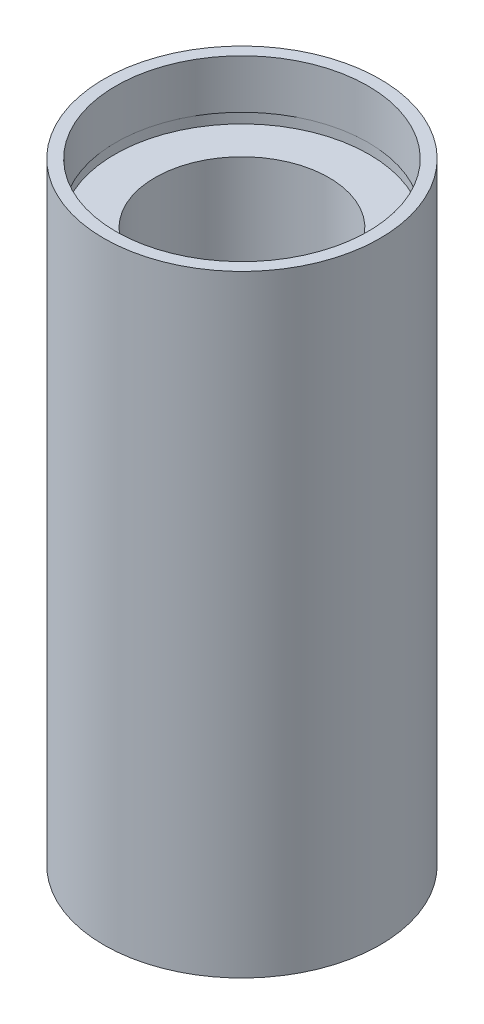
ISO-10303-21;
HEADER;
FILE_DESCRIPTION(('STEP AP214'),'2;1');
FILE_NAME('part.step','',(''),(''),'','','');
FILE_SCHEMA(('AUTOMOTIVE_DESIGN { 1 0 10303 214 1 1 1 1 }'));
ENDSEC;
DATA;
#1=APPLICATION_CONTEXT('core data for automotive mechanical design processes');
#2=APPLICATION_PROTOCOL_DEFINITION('international standard','automotive_design',2000,#1);
#3=PRODUCT_CONTEXT('',#1,'mechanical');
#4=PRODUCT('Part','Part','',(#3));
#5=PRODUCT_RELATED_PRODUCT_CATEGORY('part','',(#4));
#6=PRODUCT_DEFINITION_FORMATION('','',#4);
#7=PRODUCT_DEFINITION_CONTEXT('part definition',#1,'design');
#8=PRODUCT_DEFINITION('design','',#6,#7);
#9=PRODUCT_DEFINITION_SHAPE('','',#8);
#10=(LENGTH_UNIT() NAMED_UNIT(*) SI_UNIT(.MILLI.,.METRE.));
#11=(NAMED_UNIT(*) PLANE_ANGLE_UNIT() SI_UNIT($,.RADIAN.));
#12=(NAMED_UNIT(*) SI_UNIT($,.STERADIAN.) SOLID_ANGLE_UNIT());
#13=UNCERTAINTY_MEASURE_WITH_UNIT(LENGTH_MEASURE(1.E-05),#10,'distance_accuracy_value','');
#14=(GEOMETRIC_REPRESENTATION_CONTEXT(3) GLOBAL_UNCERTAINTY_ASSIGNED_CONTEXT((#13)) GLOBAL_UNIT_ASSIGNED_CONTEXT((#10,
#11,#12)) REPRESENTATION_CONTEXT('',''));
#15=CARTESIAN_POINT('',(0.,0.,0.));
#16=DIRECTION('',(0.,0.,1.));
#17=DIRECTION('',(1.,0.,0.));
#18=AXIS2_PLACEMENT_3D('',#15,#16,#17);
#19=CARTESIAN_POINT('',(11.1,0.,0.));
#20=DIRECTION('',(0.,1.,0.));
#21=DIRECTION('',(0.,0.,1.));
#22=AXIS2_PLACEMENT_3D('',#19,#20,#21);
#23=PLANE('',#22);
#24=CARTESIAN_POINT('',(0.,0.,0.));
#25=DIRECTION('',(0.,1.,0.));
#26=DIRECTION('',(0.,0.,1.));
#27=AXIS2_PLACEMENT_3D('',#24,#25,#26);
#28=CIRCLE('',#27,12.7);
#29=CARTESIAN_POINT('',(0.,0.,12.7));
#30=VERTEX_POINT('',#29);
#31=EDGE_CURVE('E10',#30,#30,#28,.T.);
#32=ORIENTED_EDGE('',*,*,#31,.F.);
#33=EDGE_LOOP('',(#32));
#34=FACE_BOUND('',#33,.T.);
#35=CARTESIAN_POINT('',(0.,0.,0.));
#36=DIRECTION('',(0.,1.,0.));
#37=DIRECTION('',(0.,0.,1.));
#38=AXIS2_PLACEMENT_3D('',#35,#36,#37);
#39=CIRCLE('',#38,11.1);
#40=CARTESIAN_POINT('',(0.,0.,11.1));
#41=VERTEX_POINT('',#40);
#42=EDGE_CURVE('E77',#41,#41,#39,.T.);
#43=ORIENTED_EDGE('',*,*,#42,.T.);
#44=EDGE_LOOP('',(#43));
#45=FACE_BOUND('',#44,.T.);
#46=ADVANCED_FACE('F37',(#34,#45),#23,.F.);
#47=CARTESIAN_POINT('',(0.,161.376166943427,0.));
#48=DIRECTION('',(0.,1.,0.));
#49=DIRECTION('',(0.,0.,1.));
#50=AXIS2_PLACEMENT_3D('',#47,#48,#49);
#51=CYLINDRICAL_SURFACE('',#50,12.7);
#52=CARTESIAN_POINT('',(0.,56.3,0.));
#53=DIRECTION('',(0.,1.,0.));
#54=DIRECTION('',(0.,0.,1.));
#55=AXIS2_PLACEMENT_3D('',#52,#53,#54);
#56=CIRCLE('',#55,12.7);
#57=CARTESIAN_POINT('',(0.,56.3,12.7));
#58=VERTEX_POINT('',#57);
#59=EDGE_CURVE('E43',#58,#58,#56,.T.);
#60=ORIENTED_EDGE('',*,*,#59,.F.);
#61=EDGE_LOOP('',(#60));
#62=FACE_BOUND('',#61,.T.);
#63=ORIENTED_EDGE('',*,*,#31,.T.);
#64=EDGE_LOOP('',(#63));
#65=FACE_BOUND('',#64,.T.);
#66=ADVANCED_FACE('F138',(#62,#65),#51,.T.);
#67=CARTESIAN_POINT('',(11.6,56.3,0.));
#68=DIRECTION('',(0.,-1.,0.));
#69=DIRECTION('',(0.,0.,-1.));
#70=AXIS2_PLACEMENT_3D('',#67,#68,#69);
#71=PLANE('',#70);
#72=CARTESIAN_POINT('',(0.,56.3,0.));
#73=DIRECTION('',(0.,1.,0.));
#74=DIRECTION('',(0.,0.,1.));
#75=AXIS2_PLACEMENT_3D('',#72,#73,#74);
#76=CIRCLE('',#75,11.6);
#77=CARTESIAN_POINT('',(0.,56.3,11.6));
#78=VERTEX_POINT('',#77);
#79=EDGE_CURVE('E47',#78,#78,#76,.T.);
#80=ORIENTED_EDGE('',*,*,#79,.F.);
#81=EDGE_LOOP('',(#80));
#82=FACE_BOUND('',#81,.T.);
#83=ORIENTED_EDGE('',*,*,#59,.T.);
#84=EDGE_LOOP('',(#83));
#85=FACE_BOUND('',#84,.T.);
#86=ADVANCED_FACE('F133',(#82,#85),#71,.F.);
#87=CARTESIAN_POINT('',(0.,161.376166943427,0.));
#88=DIRECTION('',(0.,1.,0.));
#89=DIRECTION('',(0.,0.,1.));
#90=AXIS2_PLACEMENT_3D('',#87,#88,#89);
#91=CYLINDRICAL_SURFACE('',#90,11.6);
#92=CARTESIAN_POINT('',(0.,51.8,0.));
#93=DIRECTION('',(0.,1.,0.));
#94=DIRECTION('',(0.,0.,1.));
#95=AXIS2_PLACEMENT_3D('',#92,#93,#94);
#96=CIRCLE('',#95,11.6);
#97=CARTESIAN_POINT('',(0.,51.8,11.6));
#98=VERTEX_POINT('',#97);
#99=EDGE_CURVE('E51',#98,#98,#96,.T.);
#100=ORIENTED_EDGE('',*,*,#99,.F.);
#101=EDGE_LOOP('',(#100));
#102=FACE_BOUND('',#101,.T.);
#103=ORIENTED_EDGE('',*,*,#79,.T.);
#104=EDGE_LOOP('',(#103));
#105=FACE_BOUND('',#104,.T.);
#106=ADVANCED_FACE('F127',(#102,#105),#91,.F.);
#107=CARTESIAN_POINT('',(11.6,51.8,0.));
#108=DIRECTION('',(0.,1.,0.));
#109=DIRECTION('',(0.,0.,1.));
#110=AXIS2_PLACEMENT_3D('',#107,#108,#109);
#111=PLANE('',#110);
#112=CARTESIAN_POINT('',(0.,51.8,0.));
#113=DIRECTION('',(0.,1.,0.));
#114=DIRECTION('',(0.,0.,1.));
#115=AXIS2_PLACEMENT_3D('',#112,#113,#114);
#116=CIRCLE('',#115,11.7);
#117=CARTESIAN_POINT('',(0.,51.8,11.7));
#118=VERTEX_POINT('',#117);
#119=EDGE_CURVE('E56',#118,#118,#116,.T.);
#120=ORIENTED_EDGE('',*,*,#119,.F.);
#121=EDGE_LOOP('',(#120));
#122=FACE_BOUND('',#121,.T.);
#123=ORIENTED_EDGE('',*,*,#99,.T.);
#124=EDGE_LOOP('',(#123));
#125=FACE_BOUND('',#124,.T.);
#126=ADVANCED_FACE('F121',(#122,#125),#111,.F.);
#127=CARTESIAN_POINT('',(0.,161.376166943427,0.));
#128=DIRECTION('',(0.,1.,0.));
#129=DIRECTION('',(0.,0.,1.));
#130=AXIS2_PLACEMENT_3D('',#127,#128,#129);
#131=CYLINDRICAL_SURFACE('',#130,11.7);
#132=CARTESIAN_POINT('',(0.,50.8,0.));
#133=DIRECTION('',(0.,1.,0.));
#134=DIRECTION('',(0.,0.,1.));
#135=AXIS2_PLACEMENT_3D('',#132,#133,#134);
#136=CIRCLE('',#135,11.7);
#137=CARTESIAN_POINT('',(0.,50.8,11.7));
#138=VERTEX_POINT('',#137);
#139=EDGE_CURVE('E59',#138,#138,#136,.T.);
#140=ORIENTED_EDGE('',*,*,#139,.F.);
#141=EDGE_LOOP('',(#140));
#142=FACE_BOUND('',#141,.T.);
#143=ORIENTED_EDGE('',*,*,#119,.T.);
#144=EDGE_LOOP('',(#143));
#145=FACE_BOUND('',#144,.T.);
#146=ADVANCED_FACE('F115',(#142,#145),#131,.F.);
#147=CARTESIAN_POINT('',(8.00000000000002,50.8,0.));
#148=DIRECTION('',(0.,-1.,0.));
#149=DIRECTION('',(0.,0.,-1.));
#150=AXIS2_PLACEMENT_3D('',#147,#148,#149);
#151=PLANE('',#150);
#152=CARTESIAN_POINT('',(0.,50.8,0.));
#153=DIRECTION('',(0.,1.,0.));
#154=DIRECTION('',(0.,0.,1.));
#155=AXIS2_PLACEMENT_3D('',#152,#153,#154);
#156=CIRCLE('',#155,8.00000000000002);
#157=CARTESIAN_POINT('',(0.,50.8,8.00000000000002));
#158=VERTEX_POINT('',#157);
#159=EDGE_CURVE('E62',#158,#158,#156,.T.);
#160=ORIENTED_EDGE('',*,*,#159,.F.);
#161=EDGE_LOOP('',(#160));
#162=FACE_BOUND('',#161,.T.);
#163=ORIENTED_EDGE('',*,*,#139,.T.);
#164=EDGE_LOOP('',(#163));
#165=FACE_BOUND('',#164,.T.);
#166=ADVANCED_FACE('F109',(#162,#165),#151,.F.);
#167=CARTESIAN_POINT('',(0.,161.376166943427,0.));
#168=DIRECTION('',(0.,1.,0.));
#169=DIRECTION('',(0.,0.,1.));
#170=AXIS2_PLACEMENT_3D('',#167,#168,#169);
#171=CYLINDRICAL_SURFACE('',#170,8.00000000000002);
#172=CARTESIAN_POINT('',(0.,5.49999999999998,0.));
#173=DIRECTION('',(0.,1.,0.));
#174=DIRECTION('',(0.,0.,1.));
#175=AXIS2_PLACEMENT_3D('',#172,#173,#174);
#176=CIRCLE('',#175,8.00000000000002);
#177=CARTESIAN_POINT('',(0.,5.49999999999998,8.00000000000002));
#178=VERTEX_POINT('',#177);
#179=EDGE_CURVE('E65',#178,#178,#176,.T.);
#180=ORIENTED_EDGE('',*,*,#179,.F.);
#181=EDGE_LOOP('',(#180));
#182=FACE_BOUND('',#181,.T.);
#183=ORIENTED_EDGE('',*,*,#159,.T.);
#184=EDGE_LOOP('',(#183));
#185=FACE_BOUND('',#184,.T.);
#186=ADVANCED_FACE('F103',(#182,#185),#171,.F.);
#187=CARTESIAN_POINT('',(11.7,5.49999999999999,0.));
#188=DIRECTION('',(0.,1.,0.));
#189=DIRECTION('',(0.,0.,1.));
#190=AXIS2_PLACEMENT_3D('',#187,#188,#189);
#191=PLANE('',#190);
#192=CARTESIAN_POINT('',(0.,5.49999999999998,0.));
#193=DIRECTION('',(0.,1.,0.));
#194=DIRECTION('',(0.,0.,1.));
#195=AXIS2_PLACEMENT_3D('',#192,#193,#194);
#196=CIRCLE('',#195,11.7);
#197=CARTESIAN_POINT('',(0.,5.49999999999998,11.7));
#198=VERTEX_POINT('',#197);
#199=EDGE_CURVE('E68',#198,#198,#196,.T.);
#200=ORIENTED_EDGE('',*,*,#199,.F.);
#201=EDGE_LOOP('',(#200));
#202=FACE_BOUND('',#201,.T.);
#203=ORIENTED_EDGE('',*,*,#179,.T.);
#204=EDGE_LOOP('',(#203));
#205=FACE_BOUND('',#204,.T.);
#206=ADVANCED_FACE('F97',(#202,#205),#191,.F.);
#207=CARTESIAN_POINT('',(0.,161.376166943427,0.));
#208=DIRECTION('',(0.,1.,0.));
#209=DIRECTION('',(0.,0.,1.));
#210=AXIS2_PLACEMENT_3D('',#207,#208,#209);
#211=CYLINDRICAL_SURFACE('',#210,11.7);
#212=CARTESIAN_POINT('',(0.,4.49999999999998,0.));
#213=DIRECTION('',(0.,1.,0.));
#214=DIRECTION('',(0.,0.,1.));
#215=AXIS2_PLACEMENT_3D('',#212,#213,#214);
#216=CIRCLE('',#215,11.7);
#217=CARTESIAN_POINT('',(0.,4.49999999999998,11.7));
#218=VERTEX_POINT('',#217);
#219=EDGE_CURVE('E71',#218,#218,#216,.T.);
#220=ORIENTED_EDGE('',*,*,#219,.F.);
#221=EDGE_LOOP('',(#220));
#222=FACE_BOUND('',#221,.T.);
#223=ORIENTED_EDGE('',*,*,#199,.T.);
#224=EDGE_LOOP('',(#223));
#225=FACE_BOUND('',#224,.T.);
#226=ADVANCED_FACE('F91',(#222,#225),#211,.F.);
#227=CARTESIAN_POINT('',(11.1,4.49999999999998,0.));
#228=DIRECTION('',(0.,-1.,0.));
#229=DIRECTION('',(0.,0.,-1.));
#230=AXIS2_PLACEMENT_3D('',#227,#228,#229);
#231=PLANE('',#230);
#232=CARTESIAN_POINT('',(0.,4.49999999999998,0.));
#233=DIRECTION('',(0.,1.,0.));
#234=DIRECTION('',(0.,0.,1.));
#235=AXIS2_PLACEMENT_3D('',#232,#233,#234);
#236=CIRCLE('',#235,11.1);
#237=CARTESIAN_POINT('',(0.,4.49999999999998,11.1));
#238=VERTEX_POINT('',#237);
#239=EDGE_CURVE('E74',#238,#238,#236,.T.);
#240=ORIENTED_EDGE('',*,*,#239,.F.);
#241=EDGE_LOOP('',(#240));
#242=FACE_BOUND('',#241,.T.);
#243=ORIENTED_EDGE('',*,*,#219,.T.);
#244=EDGE_LOOP('',(#243));
#245=FACE_BOUND('',#244,.T.);
#246=ADVANCED_FACE('F85',(#242,#245),#231,.F.);
#247=CARTESIAN_POINT('',(0.,161.376166943427,0.));
#248=DIRECTION('',(0.,1.,0.));
#249=DIRECTION('',(0.,0.,1.));
#250=AXIS2_PLACEMENT_3D('',#247,#248,#249);
#251=CYLINDRICAL_SURFACE('',#250,11.1);
#252=ORIENTED_EDGE('',*,*,#42,.F.);
#253=EDGE_LOOP('',(#252));
#254=FACE_BOUND('',#253,.T.);
#255=ORIENTED_EDGE('',*,*,#239,.T.);
#256=EDGE_LOOP('',(#255));
#257=FACE_BOUND('',#256,.T.);
#258=ADVANCED_FACE('F82',(#254,#257),#251,.F.);
#259=CLOSED_SHELL('',(#46,#66,#86,#106,#126,#146,#166,#186,#206,#226,#246,#258));
#260=MANIFOLD_SOLID_BREP('B2',#259);
#261=ADVANCED_BREP_SHAPE_REPRESENTATION('',(#18,#260),#14);
#262=SHAPE_DEFINITION_REPRESENTATION(#9,#261);
ENDSEC;
END-ISO-10303-21;
